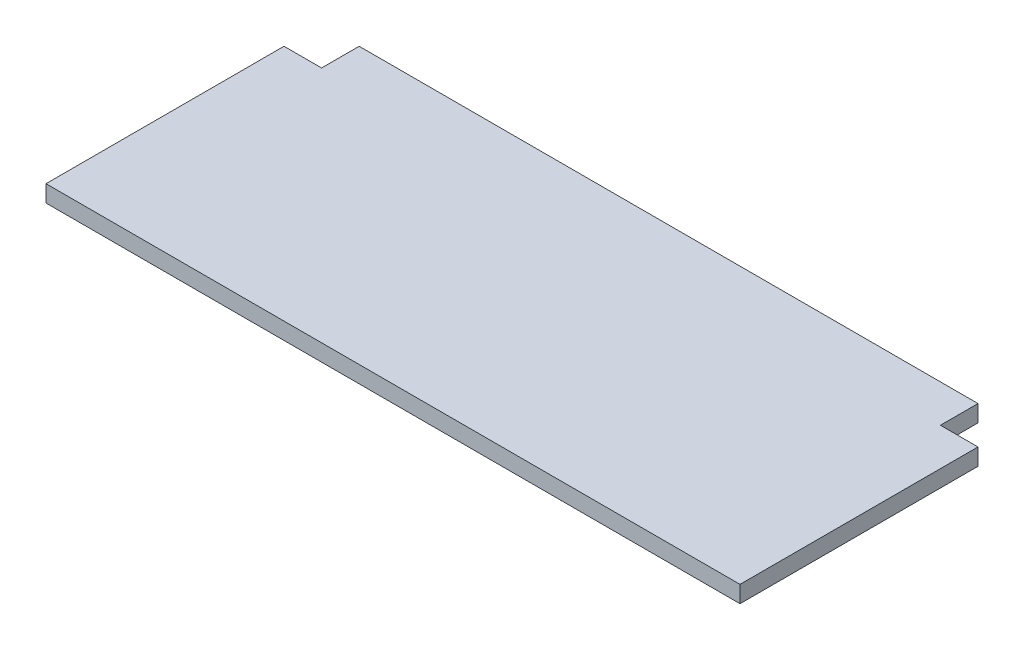
ISO-10303-21;
HEADER;
FILE_DESCRIPTION(('STEP AP214'),'2;1');
FILE_NAME('part.step','',(''),(''),'','','');
FILE_SCHEMA(('AUTOMOTIVE_DESIGN { 1 0 10303 214 1 1 1 1 }'));
ENDSEC;
DATA;
#1=APPLICATION_CONTEXT('core data for automotive mechanical design processes');
#2=APPLICATION_PROTOCOL_DEFINITION('international standard','automotive_design',2000,#1);
#3=PRODUCT_CONTEXT('',#1,'mechanical');
#4=PRODUCT('Part','Part','',(#3));
#5=PRODUCT_RELATED_PRODUCT_CATEGORY('part','',(#4));
#6=PRODUCT_DEFINITION_FORMATION('','',#4);
#7=PRODUCT_DEFINITION_CONTEXT('part definition',#1,'design');
#8=PRODUCT_DEFINITION('design','',#6,#7);
#9=PRODUCT_DEFINITION_SHAPE('','',#8);
#10=(LENGTH_UNIT() NAMED_UNIT(*) SI_UNIT(.MILLI.,.METRE.));
#11=(NAMED_UNIT(*) PLANE_ANGLE_UNIT() SI_UNIT($,.RADIAN.));
#12=(NAMED_UNIT(*) SI_UNIT($,.STERADIAN.) SOLID_ANGLE_UNIT());
#13=UNCERTAINTY_MEASURE_WITH_UNIT(LENGTH_MEASURE(1.E-05),#10,'distance_accuracy_value','');
#14=(GEOMETRIC_REPRESENTATION_CONTEXT(3) GLOBAL_UNCERTAINTY_ASSIGNED_CONTEXT((#13)) GLOBAL_UNIT_ASSIGNED_CONTEXT((#10,
#11,#12)) REPRESENTATION_CONTEXT('',''));
#15=CARTESIAN_POINT('',(0.,0.,0.));
#16=DIRECTION('',(0.,0.,1.));
#17=DIRECTION('',(1.,0.,0.));
#18=AXIS2_PLACEMENT_3D('',#15,#16,#17);
#19=CARTESIAN_POINT('',(-351.79,17.018,139.7));
#20=DIRECTION('',(1.,0.,0.));
#21=DIRECTION('',(0.,0.,-1.));
#22=AXIS2_PLACEMENT_3D('',#19,#20,#21);
#23=PLANE('',#22);
#24=DIRECTION('',(0.,0.,1.));
#25=VECTOR('',#24,1.);
#26=CARTESIAN_POINT('',(-351.79,0.,139.7));
#27=LINE('',#26,#25);
#28=CARTESIAN_POINT('',(-351.79,0.,-101.6));
#29=VERTEX_POINT('',#28);
#30=CARTESIAN_POINT('',(-351.79,0.,139.7));
#31=VERTEX_POINT('',#30);
#32=EDGE_CURVE('E140',#29,#31,#27,.T.);
#33=ORIENTED_EDGE('',*,*,#32,.T.);
#34=DIRECTION('',(0.,-1.,0.));
#35=VECTOR('',#34,1.);
#36=CARTESIAN_POINT('',(-351.79,17.018,139.7));
#37=LINE('',#36,#35);
#38=CARTESIAN_POINT('',(-351.79,17.018,139.7));
#39=VERTEX_POINT('',#38);
#40=EDGE_CURVE('E11',#39,#31,#37,.T.);
#41=ORIENTED_EDGE('',*,*,#40,.F.);
#42=DIRECTION('',(0.,0.,1.));
#43=VECTOR('',#42,1.);
#44=CARTESIAN_POINT('',(-351.79,17.018,139.7));
#45=LINE('',#44,#43);
#46=CARTESIAN_POINT('',(-351.79,17.018,-101.6));
#47=VERTEX_POINT('',#46);
#48=EDGE_CURVE('E162',#47,#39,#45,.T.);
#49=ORIENTED_EDGE('',*,*,#48,.F.);
#50=DIRECTION('',(0.,-1.,0.));
#51=VECTOR('',#50,1.);
#52=CARTESIAN_POINT('',(-351.79,17.018,-101.6));
#53=LINE('',#52,#51);
#54=EDGE_CURVE('E136',#47,#29,#53,.T.);
#55=ORIENTED_EDGE('',*,*,#54,.T.);
#56=EDGE_LOOP('',(#33,#41,#49,#55));
#57=FACE_BOUND('',#56,.T.);
#58=ADVANCED_FACE('F39',(#57),#23,.F.);
#59=CARTESIAN_POINT('',(-351.79,17.018,139.7));
#60=DIRECTION('',(0.,0.,-1.));
#61=DIRECTION('',(-1.,0.,0.));
#62=AXIS2_PLACEMENT_3D('',#59,#60,#61);
#63=PLANE('',#62);
#64=DIRECTION('',(1.,0.,0.));
#65=VECTOR('',#64,1.);
#66=CARTESIAN_POINT('',(-351.79,0.,139.7));
#67=LINE('',#66,#65);
#68=CARTESIAN_POINT('',(351.79,0.,139.7));
#69=VERTEX_POINT('',#68);
#70=EDGE_CURVE('E144',#31,#69,#67,.T.);
#71=ORIENTED_EDGE('',*,*,#70,.T.);
#72=DIRECTION('',(0.,-1.,0.));
#73=VECTOR('',#72,1.);
#74=CARTESIAN_POINT('',(351.79,17.018,139.7));
#75=LINE('',#74,#73);
#76=CARTESIAN_POINT('',(351.79,17.018,139.7));
#77=VERTEX_POINT('',#76);
#78=EDGE_CURVE('E48',#77,#69,#75,.T.);
#79=ORIENTED_EDGE('',*,*,#78,.F.);
#80=DIRECTION('',(1.,0.,0.));
#81=VECTOR('',#80,1.);
#82=CARTESIAN_POINT('',(-351.79,17.018,139.7));
#83=LINE('',#82,#81);
#84=EDGE_CURVE('E99',#39,#77,#83,.T.);
#85=ORIENTED_EDGE('',*,*,#84,.F.);
#86=ORIENTED_EDGE('',*,*,#40,.T.);
#87=EDGE_LOOP('',(#71,#79,#85,#86));
#88=FACE_BOUND('',#87,.T.);
#89=ADVANCED_FACE('F208',(#88),#63,.F.);
#90=CARTESIAN_POINT('',(351.79,17.018,139.7));
#91=DIRECTION('',(-1.,0.,0.));
#92=DIRECTION('',(0.,0.,1.));
#93=AXIS2_PLACEMENT_3D('',#90,#91,#92);
#94=PLANE('',#93);
#95=DIRECTION('',(0.,0.,-1.));
#96=VECTOR('',#95,1.);
#97=CARTESIAN_POINT('',(351.79,0.,139.7));
#98=LINE('',#97,#96);
#99=CARTESIAN_POINT('',(351.79,0.,-101.6));
#100=VERTEX_POINT('',#99);
#101=EDGE_CURVE('E147',#69,#100,#98,.T.);
#102=ORIENTED_EDGE('',*,*,#101,.T.);
#103=DIRECTION('',(0.,-1.,0.));
#104=VECTOR('',#103,1.);
#105=CARTESIAN_POINT('',(351.79,17.018,-101.6));
#106=LINE('',#105,#104);
#107=CARTESIAN_POINT('',(351.79,17.018,-101.6));
#108=VERTEX_POINT('',#107);
#109=EDGE_CURVE('E173',#108,#100,#106,.T.);
#110=ORIENTED_EDGE('',*,*,#109,.F.);
#111=DIRECTION('',(0.,0.,-1.));
#112=VECTOR('',#111,1.);
#113=CARTESIAN_POINT('',(351.79,17.018,139.7));
#114=LINE('',#113,#112);
#115=EDGE_CURVE('E183',#77,#108,#114,.T.);
#116=ORIENTED_EDGE('',*,*,#115,.F.);
#117=ORIENTED_EDGE('',*,*,#78,.T.);
#118=EDGE_LOOP('',(#102,#110,#116,#117));
#119=FACE_BOUND('',#118,.T.);
#120=ADVANCED_FACE('F181',(#119),#94,.F.);
#121=CARTESIAN_POINT('',(351.79,17.018,-101.6));
#122=DIRECTION('',(0.,0.,1.));
#123=DIRECTION('',(1.,0.,0.));
#124=AXIS2_PLACEMENT_3D('',#121,#122,#123);
#125=PLANE('',#124);
#126=DIRECTION('',(-1.,0.,0.));
#127=VECTOR('',#126,1.);
#128=CARTESIAN_POINT('',(351.79,0.,-101.6));
#129=LINE('',#128,#127);
#130=CARTESIAN_POINT('',(313.69,0.,-101.6));
#131=VERTEX_POINT('',#130);
#132=EDGE_CURVE('E150',#100,#131,#129,.T.);
#133=ORIENTED_EDGE('',*,*,#132,.T.);
#134=DIRECTION('',(0.,-1.,0.));
#135=VECTOR('',#134,1.);
#136=CARTESIAN_POINT('',(313.69,17.018,-101.6));
#137=LINE('',#136,#135);
#138=CARTESIAN_POINT('',(313.69,17.018,-101.6));
#139=VERTEX_POINT('',#138);
#140=EDGE_CURVE('E169',#139,#131,#137,.T.);
#141=ORIENTED_EDGE('',*,*,#140,.F.);
#142=DIRECTION('',(-1.,0.,0.));
#143=VECTOR('',#142,1.);
#144=CARTESIAN_POINT('',(351.79,17.018,-101.6));
#145=LINE('',#144,#143);
#146=EDGE_CURVE('E196',#108,#139,#145,.T.);
#147=ORIENTED_EDGE('',*,*,#146,.F.);
#148=ORIENTED_EDGE('',*,*,#109,.T.);
#149=EDGE_LOOP('',(#133,#141,#147,#148));
#150=FACE_BOUND('',#149,.T.);
#151=ADVANCED_FACE('F191',(#150),#125,.F.);
#152=CARTESIAN_POINT('',(313.69,17.018,-139.7));
#153=DIRECTION('',(-1.,0.,0.));
#154=DIRECTION('',(0.,0.,1.));
#155=AXIS2_PLACEMENT_3D('',#152,#153,#154);
#156=PLANE('',#155);
#157=DIRECTION('',(0.,0.,-1.));
#158=VECTOR('',#157,1.);
#159=CARTESIAN_POINT('',(313.69,0.,-139.7));
#160=LINE('',#159,#158);
#161=CARTESIAN_POINT('',(313.69,0.,-139.7));
#162=VERTEX_POINT('',#161);
#163=EDGE_CURVE('E153',#131,#162,#160,.T.);
#164=ORIENTED_EDGE('',*,*,#163,.T.);
#165=DIRECTION('',(0.,-1.,0.));
#166=VECTOR('',#165,1.);
#167=CARTESIAN_POINT('',(313.69,17.018,-139.7));
#168=LINE('',#167,#166);
#169=CARTESIAN_POINT('',(313.69,17.018,-139.7));
#170=VERTEX_POINT('',#169);
#171=EDGE_CURVE('E129',#170,#162,#168,.T.);
#172=ORIENTED_EDGE('',*,*,#171,.F.);
#173=DIRECTION('',(0.,0.,-1.));
#174=VECTOR('',#173,1.);
#175=CARTESIAN_POINT('',(313.69,17.018,-139.7));
#176=LINE('',#175,#174);
#177=EDGE_CURVE('E118',#139,#170,#176,.T.);
#178=ORIENTED_EDGE('',*,*,#177,.F.);
#179=ORIENTED_EDGE('',*,*,#140,.T.);
#180=EDGE_LOOP('',(#164,#172,#178,#179));
#181=FACE_BOUND('',#180,.T.);
#182=ADVANCED_FACE('F194',(#181),#156,.F.);
#183=CARTESIAN_POINT('',(-313.69,17.018,-139.7));
#184=DIRECTION('',(0.,0.,1.));
#185=DIRECTION('',(1.,0.,0.));
#186=AXIS2_PLACEMENT_3D('',#183,#184,#185);
#187=PLANE('',#186);
#188=DIRECTION('',(-1.,0.,0.));
#189=VECTOR('',#188,1.);
#190=CARTESIAN_POINT('',(-313.69,0.,-139.7));
#191=LINE('',#190,#189);
#192=CARTESIAN_POINT('',(-313.69,0.,-139.7));
#193=VERTEX_POINT('',#192);
#194=EDGE_CURVE('E127',#162,#193,#191,.T.);
#195=ORIENTED_EDGE('',*,*,#194,.T.);
#196=DIRECTION('',(0.,-1.,0.));
#197=VECTOR('',#196,1.);
#198=CARTESIAN_POINT('',(-313.69,17.018,-139.7));
#199=LINE('',#198,#197);
#200=CARTESIAN_POINT('',(-313.69,17.018,-139.7));
#201=VERTEX_POINT('',#200);
#202=EDGE_CURVE('E124',#201,#193,#199,.T.);
#203=ORIENTED_EDGE('',*,*,#202,.F.);
#204=DIRECTION('',(-1.,0.,0.));
#205=VECTOR('',#204,1.);
#206=CARTESIAN_POINT('',(-313.69,17.018,-139.7));
#207=LINE('',#206,#205);
#208=EDGE_CURVE('E112',#170,#201,#207,.T.);
#209=ORIENTED_EDGE('',*,*,#208,.F.);
#210=ORIENTED_EDGE('',*,*,#171,.T.);
#211=EDGE_LOOP('',(#195,#203,#209,#210));
#212=FACE_BOUND('',#211,.T.);
#213=ADVANCED_FACE('F125',(#212),#187,.F.);
#214=CARTESIAN_POINT('',(-313.69,17.018,-139.7));
#215=DIRECTION('',(1.,0.,0.));
#216=DIRECTION('',(0.,0.,-1.));
#217=AXIS2_PLACEMENT_3D('',#214,#215,#216);
#218=PLANE('',#217);
#219=DIRECTION('',(0.,0.,1.));
#220=VECTOR('',#219,1.);
#221=CARTESIAN_POINT('',(-313.69,0.,-139.7));
#222=LINE('',#221,#220);
#223=CARTESIAN_POINT('',(-313.69,0.,-101.6));
#224=VERTEX_POINT('',#223);
#225=EDGE_CURVE('E85',#193,#224,#222,.T.);
#226=ORIENTED_EDGE('',*,*,#225,.T.);
#227=DIRECTION('',(0.,-1.,0.));
#228=VECTOR('',#227,1.);
#229=CARTESIAN_POINT('',(-313.69,17.018,-101.6));
#230=LINE('',#229,#228);
#231=CARTESIAN_POINT('',(-313.69,17.018,-101.6));
#232=VERTEX_POINT('',#231);
#233=EDGE_CURVE('E130',#232,#224,#230,.T.);
#234=ORIENTED_EDGE('',*,*,#233,.F.);
#235=DIRECTION('',(0.,0.,1.));
#236=VECTOR('',#235,1.);
#237=CARTESIAN_POINT('',(-313.69,17.018,-139.7));
#238=LINE('',#237,#236);
#239=EDGE_CURVE('E116',#201,#232,#238,.T.);
#240=ORIENTED_EDGE('',*,*,#239,.F.);
#241=ORIENTED_EDGE('',*,*,#202,.T.);
#242=EDGE_LOOP('',(#226,#234,#240,#241));
#243=FACE_BOUND('',#242,.T.);
#244=ADVANCED_FACE('F132',(#243),#218,.F.);
#245=CARTESIAN_POINT('',(-351.79,17.018,-101.6));
#246=DIRECTION('',(0.,0.,1.));
#247=DIRECTION('',(1.,0.,0.));
#248=AXIS2_PLACEMENT_3D('',#245,#246,#247);
#249=PLANE('',#248);
#250=DIRECTION('',(-1.,0.,0.));
#251=VECTOR('',#250,1.);
#252=CARTESIAN_POINT('',(-351.79,0.,-101.6));
#253=LINE('',#252,#251);
#254=EDGE_CURVE('E91',#224,#29,#253,.T.);
#255=ORIENTED_EDGE('',*,*,#254,.T.);
#256=ORIENTED_EDGE('',*,*,#54,.F.);
#257=DIRECTION('',(-1.,0.,0.));
#258=VECTOR('',#257,1.);
#259=CARTESIAN_POINT('',(-351.79,17.018,-101.6));
#260=LINE('',#259,#258);
#261=EDGE_CURVE('E56',#232,#47,#260,.T.);
#262=ORIENTED_EDGE('',*,*,#261,.F.);
#263=ORIENTED_EDGE('',*,*,#233,.T.);
#264=EDGE_LOOP('',(#255,#256,#262,#263));
#265=FACE_BOUND('',#264,.T.);
#266=ADVANCED_FACE('F224',(#265),#249,.F.);
#267=CARTESIAN_POINT('',(0.,17.018,0.));
#268=DIRECTION('',(0.,-1.,0.));
#269=DIRECTION('',(0.,0.,-1.));
#270=AXIS2_PLACEMENT_3D('',#267,#268,#269);
#271=PLANE('',#270);
#272=ORIENTED_EDGE('',*,*,#48,.T.);
#273=ORIENTED_EDGE('',*,*,#84,.T.);
#274=ORIENTED_EDGE('',*,*,#115,.T.);
#275=ORIENTED_EDGE('',*,*,#146,.T.);
#276=ORIENTED_EDGE('',*,*,#177,.T.);
#277=ORIENTED_EDGE('',*,*,#208,.T.);
#278=ORIENTED_EDGE('',*,*,#239,.T.);
#279=ORIENTED_EDGE('',*,*,#261,.T.);
#280=EDGE_LOOP('',(#272,#273,#274,#275,#276,#277,#278,#279));
#281=FACE_BOUND('',#280,.T.);
#282=ADVANCED_FACE('F114',(#281),#271,.F.);
#283=CARTESIAN_POINT('',(0.,0.,0.));
#284=DIRECTION('',(0.,-1.,0.));
#285=DIRECTION('',(0.,0.,-1.));
#286=AXIS2_PLACEMENT_3D('',#283,#284,#285);
#287=PLANE('',#286);
#288=ORIENTED_EDGE('',*,*,#32,.F.);
#289=ORIENTED_EDGE('',*,*,#254,.F.);
#290=ORIENTED_EDGE('',*,*,#225,.F.);
#291=ORIENTED_EDGE('',*,*,#194,.F.);
#292=ORIENTED_EDGE('',*,*,#163,.F.);
#293=ORIENTED_EDGE('',*,*,#132,.F.);
#294=ORIENTED_EDGE('',*,*,#101,.F.);
#295=ORIENTED_EDGE('',*,*,#70,.F.);
#296=EDGE_LOOP('',(#288,#289,#290,#291,#292,#293,#294,#295));
#297=FACE_BOUND('',#296,.T.);
#298=ADVANCED_FACE('F187',(#297),#287,.T.);
#299=CLOSED_SHELL('',(#58,#89,#120,#151,#182,#213,#244,#266,#282,#298));
#300=MANIFOLD_SOLID_BREP('B2',#299);
#301=ADVANCED_BREP_SHAPE_REPRESENTATION('',(#18,#300),#14);
#302=SHAPE_DEFINITION_REPRESENTATION(#9,#301);
ENDSEC;
END-ISO-10303-21;
